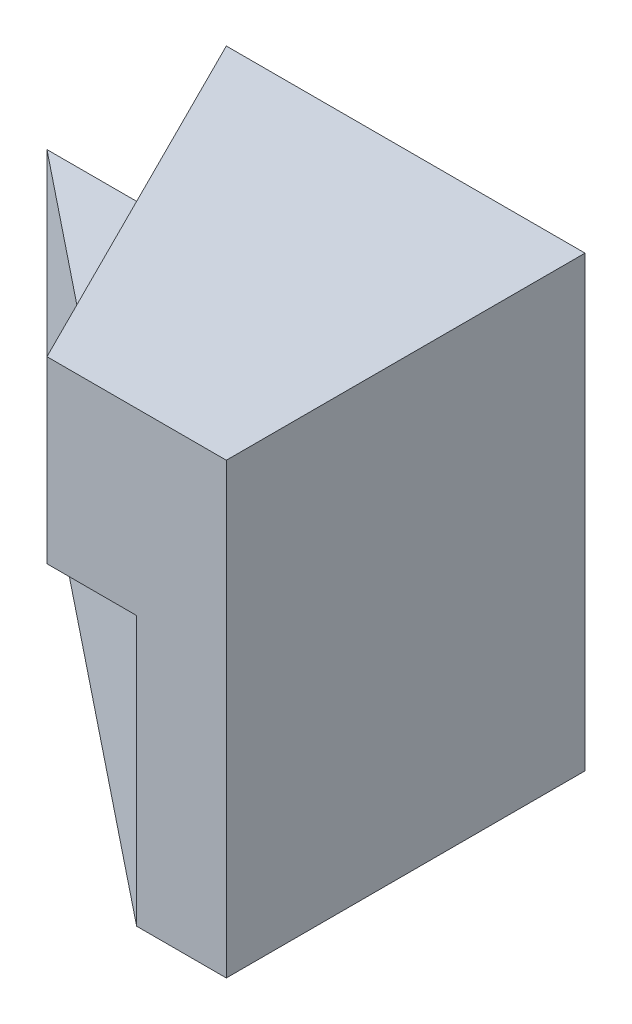
ISO-10303-21;
HEADER;
FILE_DESCRIPTION(('STEP AP214'),'2;1');
FILE_NAME('part.step','',(''),(''),'','','');
FILE_SCHEMA(('AUTOMOTIVE_DESIGN { 1 0 10303 214 1 1 1 1 }'));
ENDSEC;
DATA;
#1=APPLICATION_CONTEXT('core data for automotive mechanical design processes');
#2=APPLICATION_PROTOCOL_DEFINITION('international standard','automotive_design',2000,#1);
#3=PRODUCT_CONTEXT('',#1,'mechanical');
#4=PRODUCT('Part','Part','',(#3));
#5=PRODUCT_RELATED_PRODUCT_CATEGORY('part','',(#4));
#6=PRODUCT_DEFINITION_FORMATION('','',#4);
#7=PRODUCT_DEFINITION_CONTEXT('part definition',#1,'design');
#8=PRODUCT_DEFINITION('design','',#6,#7);
#9=PRODUCT_DEFINITION_SHAPE('','',#8);
#10=(LENGTH_UNIT() NAMED_UNIT(*) SI_UNIT(.MILLI.,.METRE.));
#11=(NAMED_UNIT(*) PLANE_ANGLE_UNIT() SI_UNIT($,.RADIAN.));
#12=(NAMED_UNIT(*) SI_UNIT($,.STERADIAN.) SOLID_ANGLE_UNIT());
#13=UNCERTAINTY_MEASURE_WITH_UNIT(LENGTH_MEASURE(1.E-05),#10,'distance_accuracy_value','');
#14=(GEOMETRIC_REPRESENTATION_CONTEXT(3) GLOBAL_UNCERTAINTY_ASSIGNED_CONTEXT((#13)) GLOBAL_UNIT_ASSIGNED_CONTEXT((#10,
#11,#12)) REPRESENTATION_CONTEXT('',''));
#15=CARTESIAN_POINT('',(0.,0.,0.));
#16=DIRECTION('',(0.,0.,1.));
#17=DIRECTION('',(1.,0.,0.));
#18=AXIS2_PLACEMENT_3D('',#15,#16,#17);
#19=CARTESIAN_POINT('',(-5.,3.,-4.));
#20=DIRECTION('',(0.,0.,1.));
#21=DIRECTION('',(1.,0.,0.));
#22=AXIS2_PLACEMENT_3D('',#19,#20,#21);
#23=PLANE('',#22);
#24=DIRECTION('',(0.,-1.,0.));
#25=VECTOR('',#24,1.);
#26=CARTESIAN_POINT('',(1.,0.,-4.));
#27=LINE('',#26,#25);
#28=CARTESIAN_POINT('',(1.,5.,-4.));
#29=VERTEX_POINT('',#28);
#30=CARTESIAN_POINT('',(1.,0.,-4.));
#31=VERTEX_POINT('',#30);
#32=EDGE_CURVE('E100',#29,#31,#27,.T.);
#33=ORIENTED_EDGE('',*,*,#32,.T.);
#34=DIRECTION('',(-1.,0.,0.));
#35=VECTOR('',#34,1.);
#36=CARTESIAN_POINT('',(-5.,0.,-4.));
#37=LINE('',#36,#35);
#38=CARTESIAN_POINT('',(-5.,0.,-4.));
#39=VERTEX_POINT('',#38);
#40=EDGE_CURVE('E78',#31,#39,#37,.T.);
#41=ORIENTED_EDGE('',*,*,#40,.T.);
#42=DIRECTION('',(0.,-1.,0.));
#43=VECTOR('',#42,1.);
#44=CARTESIAN_POINT('',(-5.,3.,-4.));
#45=LINE('',#44,#43);
#46=CARTESIAN_POINT('',(-5.,3.,-4.));
#47=VERTEX_POINT('',#46);
#48=EDGE_CURVE('E11',#47,#39,#45,.T.);
#49=ORIENTED_EDGE('',*,*,#48,.F.);
#50=DIRECTION('',(-1.,0.,0.));
#51=VECTOR('',#50,1.);
#52=CARTESIAN_POINT('',(-5.,3.,-4.));
#53=LINE('',#52,#51);
#54=CARTESIAN_POINT('',(-3.,3.,-4.));
#55=VERTEX_POINT('',#54);
#56=EDGE_CURVE('E77',#55,#47,#53,.T.);
#57=ORIENTED_EDGE('',*,*,#56,.F.);
#58=DIRECTION('',(0.,1.,0.));
#59=VECTOR('',#58,1.);
#60=CARTESIAN_POINT('',(-3.,5.,-4.));
#61=LINE('',#60,#59);
#62=CARTESIAN_POINT('',(-3.,5.,-4.));
#63=VERTEX_POINT('',#62);
#64=EDGE_CURVE('E103',#55,#63,#61,.T.);
#65=ORIENTED_EDGE('',*,*,#64,.T.);
#66=DIRECTION('',(1.,0.,0.));
#67=VECTOR('',#66,1.);
#68=CARTESIAN_POINT('',(-1.,5.,-4.));
#69=LINE('',#68,#67);
#70=EDGE_CURVE('E107',#63,#29,#69,.T.);
#71=ORIENTED_EDGE('',*,*,#70,.T.);
#72=EDGE_LOOP('',(#33,#41,#49,#57,#65,#71));
#73=FACE_BOUND('',#72,.T.);
#74=ADVANCED_FACE('F33',(#73),#23,.F.);
#75=CARTESIAN_POINT('',(0.,3.,0.));
#76=DIRECTION('',(0.624695047554424,0.,-0.78086880944303));
#77=DIRECTION('',(-0.78086880944303,0.,-0.624695047554424));
#78=AXIS2_PLACEMENT_3D('',#75,#76,#77);
#79=PLANE('',#78);
#80=DIRECTION('',(0.78086880944303,0.,0.624695047554424));
#81=VECTOR('',#80,1.);
#82=CARTESIAN_POINT('',(0.,0.,0.));
#83=LINE('',#82,#81);
#84=CARTESIAN_POINT('',(0.,0.,0.));
#85=VERTEX_POINT('',#84);
#86=EDGE_CURVE('E68',#39,#85,#83,.T.);
#87=ORIENTED_EDGE('',*,*,#86,.T.);
#88=DIRECTION('',(0.,-1.,0.));
#89=VECTOR('',#88,1.);
#90=CARTESIAN_POINT('',(0.,3.,0.));
#91=LINE('',#90,#89);
#92=CARTESIAN_POINT('',(0.,3.,0.));
#93=VERTEX_POINT('',#92);
#94=EDGE_CURVE('E40',#93,#85,#91,.T.);
#95=ORIENTED_EDGE('',*,*,#94,.F.);
#96=DIRECTION('',(0.78086880944303,0.,0.624695047554424));
#97=VECTOR('',#96,1.);
#98=CARTESIAN_POINT('',(0.,3.,0.));
#99=LINE('',#98,#97);
#100=CARTESIAN_POINT('',(-1.66666666666667,3.,-1.33333333333333));
#101=VERTEX_POINT('',#100);
#102=EDGE_CURVE('E55',#101,#93,#99,.T.);
#103=ORIENTED_EDGE('',*,*,#102,.F.);
#104=EDGE_CURVE('E87',#47,#101,#99,.T.);
#105=ORIENTED_EDGE('',*,*,#104,.F.);
#106=ORIENTED_EDGE('',*,*,#48,.T.);
#107=EDGE_LOOP('',(#87,#95,#103,#105,#106));
#108=FACE_BOUND('',#107,.T.);
#109=ADVANCED_FACE('F70',(#108),#79,.F.);
#110=CARTESIAN_POINT('',(0.,3.,0.));
#111=DIRECTION('',(0.,1.,0.));
#112=DIRECTION('',(0.,0.,1.));
#113=AXIS2_PLACEMENT_3D('',#110,#111,#112);
#114=PLANE('',#113);
#115=ORIENTED_EDGE('',*,*,#104,.T.);
#116=DIRECTION('',(-0.447213595499958,0.,-0.894427190999916));
#117=VECTOR('',#116,1.);
#118=CARTESIAN_POINT('',(-3.,3.,-4.));
#119=LINE('',#118,#117);
#120=EDGE_CURVE('E142',#101,#55,#119,.T.);
#121=ORIENTED_EDGE('',*,*,#120,.T.);
#122=ORIENTED_EDGE('',*,*,#56,.T.);
#123=EDGE_LOOP('',(#115,#121,#122));
#124=FACE_BOUND('',#123,.T.);
#125=ADVANCED_FACE('F160',(#124),#114,.T.);
#126=CARTESIAN_POINT('',(0.,0.,0.));
#127=DIRECTION('',(0.,1.,0.));
#128=DIRECTION('',(0.,0.,1.));
#129=AXIS2_PLACEMENT_3D('',#126,#127,#128);
#130=PLANE('',#129);
#131=ORIENTED_EDGE('',*,*,#40,.F.);
#132=DIRECTION('',(0.,0.,-1.));
#133=VECTOR('',#132,1.);
#134=CARTESIAN_POINT('',(1.,0.,0.));
#135=LINE('',#134,#133);
#136=CARTESIAN_POINT('',(1.,0.,0.));
#137=VERTEX_POINT('',#136);
#138=EDGE_CURVE('E91',#137,#31,#135,.T.);
#139=ORIENTED_EDGE('',*,*,#138,.F.);
#140=DIRECTION('',(-1.,0.,0.));
#141=VECTOR('',#140,1.);
#142=CARTESIAN_POINT('',(1.,0.,0.));
#143=LINE('',#142,#141);
#144=EDGE_CURVE('E84',#137,#85,#143,.T.);
#145=ORIENTED_EDGE('',*,*,#144,.T.);
#146=ORIENTED_EDGE('',*,*,#86,.F.);
#147=EDGE_LOOP('',(#131,#139,#145,#146));
#148=FACE_BOUND('',#147,.T.);
#149=ADVANCED_FACE('F89',(#148),#130,.F.);
#150=CARTESIAN_POINT('',(0.,3.,0.));
#151=DIRECTION('',(0.,-1.,0.));
#152=DIRECTION('',(0.,0.,-1.));
#153=AXIS2_PLACEMENT_3D('',#150,#151,#152);
#154=PLANE('',#153);
#155=CARTESIAN_POINT('',(-1.,3.,0.));
#156=VERTEX_POINT('',#155);
#157=EDGE_CURVE('E47',#156,#101,#119,.T.);
#158=ORIENTED_EDGE('',*,*,#157,.T.);
#159=ORIENTED_EDGE('',*,*,#102,.T.);
#160=DIRECTION('',(-1.,0.,0.));
#161=VECTOR('',#160,1.);
#162=CARTESIAN_POINT('',(0.,3.,0.));
#163=LINE('',#162,#161);
#164=EDGE_CURVE('E86',#93,#156,#163,.T.);
#165=ORIENTED_EDGE('',*,*,#164,.T.);
#166=EDGE_LOOP('',(#158,#159,#165));
#167=FACE_BOUND('',#166,.T.);
#168=ADVANCED_FACE('F152',(#167),#154,.T.);
#169=CARTESIAN_POINT('',(-1.,5.,0.));
#170=DIRECTION('',(0.,1.,0.));
#171=DIRECTION('',(0.,0.,1.));
#172=AXIS2_PLACEMENT_3D('',#169,#170,#171);
#173=PLANE('',#172);
#174=DIRECTION('',(-0.447213595499958,0.,-0.894427190999916));
#175=VECTOR('',#174,1.);
#176=CARTESIAN_POINT('',(-3.,5.,-4.));
#177=LINE('',#176,#175);
#178=CARTESIAN_POINT('',(-1.,5.,0.));
#179=VERTEX_POINT('',#178);
#180=EDGE_CURVE('E147',#179,#63,#177,.T.);
#181=ORIENTED_EDGE('',*,*,#180,.F.);
#182=DIRECTION('',(1.,0.,0.));
#183=VECTOR('',#182,1.);
#184=CARTESIAN_POINT('',(1.,5.,0.));
#185=LINE('',#184,#183);
#186=CARTESIAN_POINT('',(1.,5.,0.));
#187=VERTEX_POINT('',#186);
#188=EDGE_CURVE('E96',#179,#187,#185,.T.);
#189=ORIENTED_EDGE('',*,*,#188,.T.);
#190=DIRECTION('',(0.,0.,-1.));
#191=VECTOR('',#190,1.);
#192=CARTESIAN_POINT('',(1.,5.,0.));
#193=LINE('',#192,#191);
#194=EDGE_CURVE('E94',#187,#29,#193,.T.);
#195=ORIENTED_EDGE('',*,*,#194,.T.);
#196=ORIENTED_EDGE('',*,*,#70,.F.);
#197=EDGE_LOOP('',(#181,#189,#195,#196));
#198=FACE_BOUND('',#197,.T.);
#199=ADVANCED_FACE('F149',(#198),#173,.T.);
#200=CARTESIAN_POINT('',(1.,0.,0.));
#201=DIRECTION('',(1.,0.,0.));
#202=DIRECTION('',(0.,0.,-1.));
#203=AXIS2_PLACEMENT_3D('',#200,#201,#202);
#204=PLANE('',#203);
#205=ORIENTED_EDGE('',*,*,#32,.F.);
#206=ORIENTED_EDGE('',*,*,#194,.F.);
#207=DIRECTION('',(0.,-1.,0.));
#208=VECTOR('',#207,1.);
#209=CARTESIAN_POINT('',(1.,0.,0.));
#210=LINE('',#209,#208);
#211=EDGE_CURVE('E92',#187,#137,#210,.T.);
#212=ORIENTED_EDGE('',*,*,#211,.T.);
#213=ORIENTED_EDGE('',*,*,#138,.T.);
#214=EDGE_LOOP('',(#205,#206,#212,#213));
#215=FACE_BOUND('',#214,.T.);
#216=ADVANCED_FACE('F123',(#215),#204,.T.);
#217=CARTESIAN_POINT('',(0.,0.,0.));
#218=DIRECTION('',(0.,0.,1.));
#219=DIRECTION('',(1.,0.,0.));
#220=AXIS2_PLACEMENT_3D('',#217,#218,#219);
#221=PLANE('',#220);
#222=DIRECTION('',(0.,1.,0.));
#223=VECTOR('',#222,1.);
#224=CARTESIAN_POINT('',(-1.,3.,0.));
#225=LINE('',#224,#223);
#226=EDGE_CURVE('E104',#156,#179,#225,.T.);
#227=ORIENTED_EDGE('',*,*,#226,.F.);
#228=ORIENTED_EDGE('',*,*,#164,.F.);
#229=ORIENTED_EDGE('',*,*,#94,.T.);
#230=ORIENTED_EDGE('',*,*,#144,.F.);
#231=ORIENTED_EDGE('',*,*,#211,.F.);
#232=ORIENTED_EDGE('',*,*,#188,.F.);
#233=EDGE_LOOP('',(#227,#228,#229,#230,#231,#232));
#234=FACE_BOUND('',#233,.T.);
#235=ADVANCED_FACE('F82',(#234),#221,.T.);
#236=CARTESIAN_POINT('',(-3.,3.,-4.));
#237=DIRECTION('',(0.894427190999916,0.,-0.447213595499958));
#238=DIRECTION('',(-0.447213595499958,0.,-0.894427190999916));
#239=AXIS2_PLACEMENT_3D('',#236,#237,#238);
#240=PLANE('',#239);
#241=ORIENTED_EDGE('',*,*,#180,.T.);
#242=ORIENTED_EDGE('',*,*,#64,.F.);
#243=ORIENTED_EDGE('',*,*,#120,.F.);
#244=ORIENTED_EDGE('',*,*,#157,.F.);
#245=ORIENTED_EDGE('',*,*,#226,.T.);
#246=EDGE_LOOP('',(#241,#242,#243,#244,#245));
#247=FACE_BOUND('',#246,.T.);
#248=ADVANCED_FACE('F146',(#247),#240,.F.);
#249=CLOSED_SHELL('',(#74,#109,#125,#149,#168,#199,#216,#235,#248));
#250=MANIFOLD_SOLID_BREP('B2',#249);
#251=ADVANCED_BREP_SHAPE_REPRESENTATION('',(#18,#250),#14);
#252=SHAPE_DEFINITION_REPRESENTATION(#9,#251);
ENDSEC;
END-ISO-10303-21;
